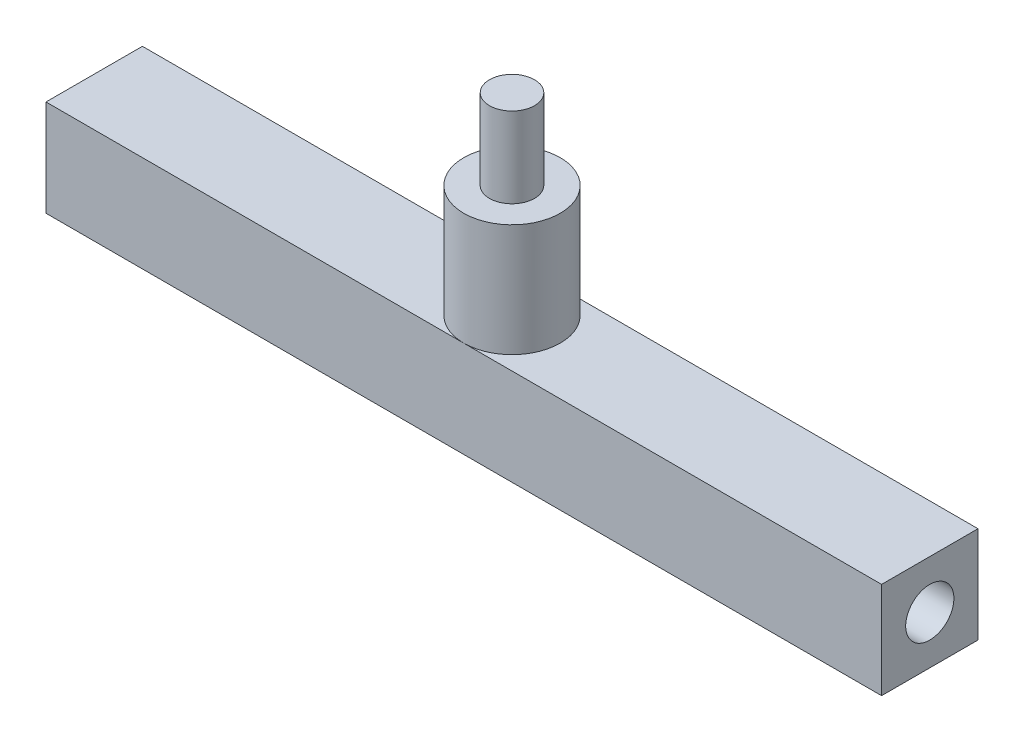
ISO-10303-21;
HEADER;
FILE_DESCRIPTION(('STEP AP214'),'2;1');
FILE_NAME('part.step','',(''),(''),'','','');
FILE_SCHEMA(('AUTOMOTIVE_DESIGN { 1 0 10303 214 1 1 1 1 }'));
ENDSEC;
DATA;
#1=APPLICATION_CONTEXT('core data for automotive mechanical design processes');
#2=APPLICATION_PROTOCOL_DEFINITION('international standard','automotive_design',2000,#1);
#3=PRODUCT_CONTEXT('',#1,'mechanical');
#4=PRODUCT('Part','Part','',(#3));
#5=PRODUCT_RELATED_PRODUCT_CATEGORY('part','',(#4));
#6=PRODUCT_DEFINITION_FORMATION('','',#4);
#7=PRODUCT_DEFINITION_CONTEXT('part definition',#1,'design');
#8=PRODUCT_DEFINITION('design','',#6,#7);
#9=PRODUCT_DEFINITION_SHAPE('','',#8);
#10=(LENGTH_UNIT() NAMED_UNIT(*) SI_UNIT(.MILLI.,.METRE.));
#11=(NAMED_UNIT(*) PLANE_ANGLE_UNIT() SI_UNIT($,.RADIAN.));
#12=(NAMED_UNIT(*) SI_UNIT($,.STERADIAN.) SOLID_ANGLE_UNIT());
#13=UNCERTAINTY_MEASURE_WITH_UNIT(LENGTH_MEASURE(1.E-05),#10,'distance_accuracy_value','');
#14=(GEOMETRIC_REPRESENTATION_CONTEXT(3) GLOBAL_UNCERTAINTY_ASSIGNED_CONTEXT((#13)) GLOBAL_UNIT_ASSIGNED_CONTEXT((#10,
#11,#12)) REPRESENTATION_CONTEXT('',''));
#15=CARTESIAN_POINT('',(0.,0.,0.));
#16=DIRECTION('',(0.,0.,1.));
#17=DIRECTION('',(1.,0.,0.));
#18=AXIS2_PLACEMENT_3D('',#15,#16,#17);
#19=CARTESIAN_POINT('',(0.,6.,0.));
#20=DIRECTION('',(0.,-1.,0.));
#21=DIRECTION('',(0.,0.,-1.));
#22=AXIS2_PLACEMENT_3D('',#19,#20,#21);
#23=PLANE('',#22);
#24=CARTESIAN_POINT('',(26.,6.,-3.));
#25=DIRECTION('',(0.,1.,0.));
#26=DIRECTION('',(0.,0.,1.));
#27=AXIS2_PLACEMENT_3D('',#24,#25,#26);
#28=CIRCLE('',#27,3.);
#29=CARTESIAN_POINT('',(26.,6.,0.));
#30=VERTEX_POINT('',#29);
#31=CARTESIAN_POINT('',(26.,6.,-6.));
#32=VERTEX_POINT('',#31);
#33=EDGE_CURVE('E43',#30,#32,#28,.T.);
#34=ORIENTED_EDGE('',*,*,#33,.F.);
#35=DIRECTION('',(1.,0.,0.));
#36=VECTOR('',#35,1.);
#37=CARTESIAN_POINT('',(0.,6.,0.));
#38=LINE('',#37,#36);
#39=CARTESIAN_POINT('',(52.,6.,0.));
#40=VERTEX_POINT('',#39);
#41=EDGE_CURVE('E134',#30,#40,#38,.T.);
#42=ORIENTED_EDGE('',*,*,#41,.T.);
#43=DIRECTION('',(0.,0.,-1.));
#44=VECTOR('',#43,1.);
#45=CARTESIAN_POINT('',(52.,6.,0.));
#46=LINE('',#45,#44);
#47=CARTESIAN_POINT('',(52.,6.,-6.));
#48=VERTEX_POINT('',#47);
#49=EDGE_CURVE('E136',#40,#48,#46,.T.);
#50=ORIENTED_EDGE('',*,*,#49,.T.);
#51=DIRECTION('',(-1.,0.,0.));
#52=VECTOR('',#51,1.);
#53=CARTESIAN_POINT('',(0.,6.,-6.));
#54=LINE('',#53,#52);
#55=EDGE_CURVE('E138',#48,#32,#54,.T.);
#56=ORIENTED_EDGE('',*,*,#55,.T.);
#57=EDGE_LOOP('',(#34,#42,#50,#56));
#58=FACE_BOUND('',#57,.T.);
#59=ADVANCED_FACE('F33',(#58),#23,.F.);
#60=CARTESIAN_POINT('',(0.,6.,0.));
#61=DIRECTION('',(1.,0.,0.));
#62=DIRECTION('',(0.,0.,-1.));
#63=AXIS2_PLACEMENT_3D('',#60,#61,#62);
#64=PLANE('',#63);
#65=CARTESIAN_POINT('',(0.,3.,-3.));
#66=DIRECTION('',(-1.,0.,0.));
#67=DIRECTION('',(0.,0.,1.));
#68=AXIS2_PLACEMENT_3D('',#65,#66,#67);
#69=CIRCLE('',#68,1.49999999999999);
#70=CARTESIAN_POINT('',(0.,3.,-1.50000000000001));
#71=VERTEX_POINT('',#70);
#72=EDGE_CURVE('E348',#71,#71,#69,.T.);
#73=ORIENTED_EDGE('',*,*,#72,.F.);
#74=EDGE_LOOP('',(#73));
#75=FACE_BOUND('',#74,.T.);
#76=DIRECTION('',(0.,0.,1.));
#77=VECTOR('',#76,1.);
#78=CARTESIAN_POINT('',(0.,0.,0.));
#79=LINE('',#78,#77);
#80=CARTESIAN_POINT('',(0.,0.,-6.));
#81=VERTEX_POINT('',#80);
#82=CARTESIAN_POINT('',(0.,0.,0.));
#83=VERTEX_POINT('',#82);
#84=EDGE_CURVE('E129',#81,#83,#79,.T.);
#85=ORIENTED_EDGE('',*,*,#84,.T.);
#86=DIRECTION('',(0.,-1.,0.));
#87=VECTOR('',#86,1.);
#88=CARTESIAN_POINT('',(0.,6.,0.));
#89=LINE('',#88,#87);
#90=CARTESIAN_POINT('',(0.,6.,0.));
#91=VERTEX_POINT('',#90);
#92=EDGE_CURVE('E37',#91,#83,#89,.T.);
#93=ORIENTED_EDGE('',*,*,#92,.F.);
#94=DIRECTION('',(0.,0.,1.));
#95=VECTOR('',#94,1.);
#96=CARTESIAN_POINT('',(0.,6.,0.));
#97=LINE('',#96,#95);
#98=CARTESIAN_POINT('',(0.,6.,-6.));
#99=VERTEX_POINT('',#98);
#100=EDGE_CURVE('E132',#99,#91,#97,.T.);
#101=ORIENTED_EDGE('',*,*,#100,.F.);
#102=DIRECTION('',(0.,-1.,0.));
#103=VECTOR('',#102,1.);
#104=CARTESIAN_POINT('',(0.,6.,-6.));
#105=LINE('',#104,#103);
#106=EDGE_CURVE('E141',#99,#81,#105,.T.);
#107=ORIENTED_EDGE('',*,*,#106,.T.);
#108=EDGE_LOOP('',(#85,#93,#101,#107));
#109=FACE_BOUND('',#108,.T.);
#110=ADVANCED_FACE('F35',(#75,#109),#64,.F.);
#111=CARTESIAN_POINT('',(0.,6.,0.));
#112=DIRECTION('',(0.,0.,-1.));
#113=DIRECTION('',(-1.,0.,0.));
#114=AXIS2_PLACEMENT_3D('',#111,#112,#113);
#115=PLANE('',#114);
#116=DIRECTION('',(1.,0.,0.));
#117=VECTOR('',#116,1.);
#118=CARTESIAN_POINT('',(0.,0.,0.));
#119=LINE('',#118,#117);
#120=CARTESIAN_POINT('',(52.,0.,0.));
#121=VERTEX_POINT('',#120);
#122=EDGE_CURVE('E144',#83,#121,#119,.T.);
#123=ORIENTED_EDGE('',*,*,#122,.T.);
#124=DIRECTION('',(0.,-1.,0.));
#125=VECTOR('',#124,1.);
#126=CARTESIAN_POINT('',(52.,6.,0.));
#127=LINE('',#126,#125);
#128=EDGE_CURVE('E151',#40,#121,#127,.T.);
#129=ORIENTED_EDGE('',*,*,#128,.F.);
#130=ORIENTED_EDGE('',*,*,#41,.F.);
#131=EDGE_CURVE('E82',#91,#30,#38,.T.);
#132=ORIENTED_EDGE('',*,*,#131,.F.);
#133=ORIENTED_EDGE('',*,*,#92,.T.);
#134=EDGE_LOOP('',(#123,#129,#130,#132,#133));
#135=FACE_BOUND('',#134,.T.);
#136=ADVANCED_FACE('F158',(#135),#115,.F.);
#137=CARTESIAN_POINT('',(52.,6.,0.));
#138=DIRECTION('',(-1.,0.,0.));
#139=DIRECTION('',(0.,0.,1.));
#140=AXIS2_PLACEMENT_3D('',#137,#138,#139);
#141=PLANE('',#140);
#142=CARTESIAN_POINT('',(52.,3.,-3.));
#143=DIRECTION('',(1.,0.,0.));
#144=DIRECTION('',(0.,0.,-1.));
#145=AXIS2_PLACEMENT_3D('',#142,#143,#144);
#146=CIRCLE('',#145,1.49999999999999);
#147=CARTESIAN_POINT('',(52.,3.,-4.49999999999999));
#148=VERTEX_POINT('',#147);
#149=EDGE_CURVE('E102',#148,#148,#146,.T.);
#150=ORIENTED_EDGE('',*,*,#149,.F.);
#151=EDGE_LOOP('',(#150));
#152=FACE_BOUND('',#151,.T.);
#153=DIRECTION('',(0.,0.,-1.));
#154=VECTOR('',#153,1.);
#155=CARTESIAN_POINT('',(52.,0.,0.));
#156=LINE('',#155,#154);
#157=CARTESIAN_POINT('',(52.,0.,-6.));
#158=VERTEX_POINT('',#157);
#159=EDGE_CURVE('E146',#121,#158,#156,.T.);
#160=ORIENTED_EDGE('',*,*,#159,.T.);
#161=DIRECTION('',(0.,-1.,0.));
#162=VECTOR('',#161,1.);
#163=CARTESIAN_POINT('',(52.,6.,-6.));
#164=LINE('',#163,#162);
#165=EDGE_CURVE('E150',#48,#158,#164,.T.);
#166=ORIENTED_EDGE('',*,*,#165,.F.);
#167=ORIENTED_EDGE('',*,*,#49,.F.);
#168=ORIENTED_EDGE('',*,*,#128,.T.);
#169=EDGE_LOOP('',(#160,#166,#167,#168));
#170=FACE_BOUND('',#169,.T.);
#171=ADVANCED_FACE('F165',(#152,#170),#141,.F.);
#172=CARTESIAN_POINT('',(0.,6.,-6.));
#173=DIRECTION('',(0.,0.,1.));
#174=DIRECTION('',(1.,0.,0.));
#175=AXIS2_PLACEMENT_3D('',#172,#173,#174);
#176=PLANE('',#175);
#177=DIRECTION('',(-1.,0.,0.));
#178=VECTOR('',#177,1.);
#179=CARTESIAN_POINT('',(0.,0.,-6.));
#180=LINE('',#179,#178);
#181=EDGE_CURVE('E75',#158,#81,#180,.T.);
#182=ORIENTED_EDGE('',*,*,#181,.T.);
#183=ORIENTED_EDGE('',*,*,#106,.F.);
#184=EDGE_CURVE('E53',#32,#99,#54,.T.);
#185=ORIENTED_EDGE('',*,*,#184,.F.);
#186=ORIENTED_EDGE('',*,*,#55,.F.);
#187=ORIENTED_EDGE('',*,*,#165,.T.);
#188=EDGE_LOOP('',(#182,#183,#185,#186,#187));
#189=FACE_BOUND('',#188,.T.);
#190=ADVANCED_FACE('F167',(#189),#176,.F.);
#191=EDGE_CURVE('E11',#32,#30,#28,.T.);
#192=ORIENTED_EDGE('',*,*,#191,.F.);
#193=ORIENTED_EDGE('',*,*,#184,.T.);
#194=ORIENTED_EDGE('',*,*,#100,.T.);
#195=ORIENTED_EDGE('',*,*,#131,.T.);
#196=EDGE_LOOP('',(#192,#193,#194,#195));
#197=FACE_BOUND('',#196,.T.);
#198=ADVANCED_FACE('F183',(#197),#23,.F.);
#199=CARTESIAN_POINT('',(0.,0.,0.));
#200=DIRECTION('',(0.,-1.,0.));
#201=DIRECTION('',(0.,0.,-1.));
#202=AXIS2_PLACEMENT_3D('',#199,#200,#201);
#203=PLANE('',#202);
#204=ORIENTED_EDGE('',*,*,#84,.F.);
#205=ORIENTED_EDGE('',*,*,#181,.F.);
#206=ORIENTED_EDGE('',*,*,#159,.F.);
#207=ORIENTED_EDGE('',*,*,#122,.F.);
#208=EDGE_LOOP('',(#204,#205,#206,#207));
#209=FACE_BOUND('',#208,.T.);
#210=ADVANCED_FACE('F163',(#209),#203,.T.);
#211=CARTESIAN_POINT('',(26.,13.,-3.));
#212=DIRECTION('',(0.,-1.,0.));
#213=DIRECTION('',(0.,0.,-1.));
#214=AXIS2_PLACEMENT_3D('',#211,#212,#213);
#215=CYLINDRICAL_SURFACE('',#214,3.);
#216=CARTESIAN_POINT('',(26.,13.,-3.));
#217=DIRECTION('',(0.,1.,0.));
#218=DIRECTION('',(0.,0.,1.));
#219=AXIS2_PLACEMENT_3D('',#216,#217,#218);
#220=CIRCLE('',#219,3.);
#221=CARTESIAN_POINT('',(26.,13.,0.));
#222=VERTEX_POINT('',#221);
#223=EDGE_CURVE('E127',#222,#222,#220,.T.);
#224=ORIENTED_EDGE('',*,*,#223,.F.);
#225=EDGE_LOOP('',(#224));
#226=FACE_BOUND('',#225,.T.);
#227=ORIENTED_EDGE('',*,*,#33,.T.);
#228=ORIENTED_EDGE('',*,*,#191,.T.);
#229=EDGE_LOOP('',(#227,#228));
#230=FACE_BOUND('',#229,.T.);
#231=ADVANCED_FACE('F171',(#226,#230),#215,.T.);
#232=CARTESIAN_POINT('',(26.,13.,-3.));
#233=DIRECTION('',(0.,1.,0.));
#234=DIRECTION('',(0.,0.,1.));
#235=AXIS2_PLACEMENT_3D('',#232,#233,#234);
#236=PLANE('',#235);
#237=CARTESIAN_POINT('',(26.,13.,-3.));
#238=DIRECTION('',(0.,1.,0.));
#239=DIRECTION('',(0.,0.,1.));
#240=AXIS2_PLACEMENT_3D('',#237,#238,#239);
#241=CIRCLE('',#240,1.4);
#242=CARTESIAN_POINT('',(26.,13.,-1.6));
#243=VERTEX_POINT('',#242);
#244=EDGE_CURVE('E121',#243,#243,#241,.T.);
#245=ORIENTED_EDGE('',*,*,#244,.F.);
#246=EDGE_LOOP('',(#245));
#247=FACE_BOUND('',#246,.T.);
#248=ORIENTED_EDGE('',*,*,#223,.T.);
#249=EDGE_LOOP('',(#248));
#250=FACE_BOUND('',#249,.T.);
#251=ADVANCED_FACE('F173',(#247,#250),#236,.T.);
#252=CARTESIAN_POINT('',(26.,18.,-3.));
#253=DIRECTION('',(0.,-1.,0.));
#254=DIRECTION('',(0.,0.,-1.));
#255=AXIS2_PLACEMENT_3D('',#252,#253,#254);
#256=CYLINDRICAL_SURFACE('',#255,1.4);
#257=CARTESIAN_POINT('',(26.,18.,-3.));
#258=DIRECTION('',(0.,1.,0.));
#259=DIRECTION('',(0.,0.,1.));
#260=AXIS2_PLACEMENT_3D('',#257,#258,#259);
#261=CIRCLE('',#260,1.4);
#262=CARTESIAN_POINT('',(26.,18.,-1.6));
#263=VERTEX_POINT('',#262);
#264=EDGE_CURVE('E122',#263,#263,#261,.T.);
#265=ORIENTED_EDGE('',*,*,#264,.F.);
#266=EDGE_LOOP('',(#265));
#267=FACE_BOUND('',#266,.T.);
#268=ORIENTED_EDGE('',*,*,#244,.T.);
#269=EDGE_LOOP('',(#268));
#270=FACE_BOUND('',#269,.T.);
#271=ADVANCED_FACE('F180',(#267,#270),#256,.T.);
#272=CARTESIAN_POINT('',(26.,18.,-3.));
#273=DIRECTION('',(0.,1.,0.));
#274=DIRECTION('',(0.,0.,1.));
#275=AXIS2_PLACEMENT_3D('',#272,#273,#274);
#276=PLANE('',#275);
#277=ORIENTED_EDGE('',*,*,#264,.T.);
#278=EDGE_LOOP('',(#277));
#279=FACE_BOUND('',#278,.T.);
#280=ADVANCED_FACE('F218',(#279),#276,.T.);
#281=CARTESIAN_POINT('',(44.5,3.,-3.));
#282=DIRECTION('',(1.,0.,0.));
#283=DIRECTION('',(0.,0.,-1.));
#284=AXIS2_PLACEMENT_3D('',#281,#282,#283);
#285=CONICAL_SURFACE('',#284,1.25,1.02974425867665);
#286=CARTESIAN_POINT('',(43.7489242262155,3.,-3.));
#287=VERTEX_POINT('',#286);
#288=VERTEX_LOOP('',#287);
#289=FACE_BOUND('',#288,.T.);
#290=CARTESIAN_POINT('',(44.5,3.,-3.));
#291=DIRECTION('',(1.,0.,0.));
#292=DIRECTION('',(0.,0.,-1.));
#293=AXIS2_PLACEMENT_3D('',#290,#291,#292);
#294=CIRCLE('',#293,1.25);
#295=CARTESIAN_POINT('',(44.5,3.,-4.25));
#296=VERTEX_POINT('',#295);
#297=EDGE_CURVE('E118',#296,#296,#294,.T.);
#298=ORIENTED_EDGE('',*,*,#297,.T.);
#299=EDGE_LOOP('',(#298));
#300=FACE_BOUND('',#299,.T.);
#301=ADVANCED_FACE('F223',(#289,#300),#285,.F.);
#302=CARTESIAN_POINT('',(52.,3.,-3.));
#303=DIRECTION('',(1.,0.,0.));
#304=DIRECTION('',(0.,0.,-1.));
#305=AXIS2_PLACEMENT_3D('',#302,#303,#304);
#306=CYLINDRICAL_SURFACE('',#305,1.25);
#307=ORIENTED_EDGE('',*,*,#297,.F.);
#308=EDGE_LOOP('',(#307));
#309=FACE_BOUND('',#308,.T.);
#310=CARTESIAN_POINT('',(46.,3.,-3.));
#311=DIRECTION('',(1.,0.,0.));
#312=DIRECTION('',(0.,0.,-1.));
#313=AXIS2_PLACEMENT_3D('',#310,#311,#312);
#314=CIRCLE('',#313,1.25);
#315=CARTESIAN_POINT('',(46.,3.,-4.25));
#316=VERTEX_POINT('',#315);
#317=EDGE_CURVE('E115',#316,#316,#314,.T.);
#318=ORIENTED_EDGE('',*,*,#317,.T.);
#319=EDGE_LOOP('',(#318));
#320=FACE_BOUND('',#319,.T.);
#321=ADVANCED_FACE('F228',(#309,#320),#306,.F.);
#322=CARTESIAN_POINT('',(46.,4.25,-3.));
#323=DIRECTION('',(-1.,0.,0.));
#324=DIRECTION('',(0.,0.,1.));
#325=AXIS2_PLACEMENT_3D('',#322,#323,#324);
#326=PLANE('',#325);
#327=ORIENTED_EDGE('',*,*,#317,.F.);
#328=EDGE_LOOP('',(#327));
#329=FACE_BOUND('',#328,.T.);
#330=CARTESIAN_POINT('',(46.,3.,-3.));
#331=DIRECTION('',(1.,0.,0.));
#332=DIRECTION('',(0.,0.,-1.));
#333=AXIS2_PLACEMENT_3D('',#330,#331,#332);
#334=CIRCLE('',#333,1.5);
#335=CARTESIAN_POINT('',(46.,3.,-4.5));
#336=VERTEX_POINT('',#335);
#337=EDGE_CURVE('E106',#336,#336,#334,.T.);
#338=ORIENTED_EDGE('',*,*,#337,.T.);
#339=EDGE_LOOP('',(#338));
#340=FACE_BOUND('',#339,.T.);
#341=ADVANCED_FACE('F238',(#329,#340),#326,.F.);
#342=CARTESIAN_POINT('',(52.,3.,-3.));
#343=DIRECTION('',(1.,0.,0.));
#344=DIRECTION('',(0.,0.,-1.));
#345=AXIS2_PLACEMENT_3D('',#342,#343,#344);
#346=CYLINDRICAL_SURFACE('',#345,1.49999999999999);
#347=ORIENTED_EDGE('',*,*,#337,.F.);
#348=EDGE_LOOP('',(#347));
#349=FACE_BOUND('',#348,.T.);
#350=ORIENTED_EDGE('',*,*,#149,.T.);
#351=EDGE_LOOP('',(#350));
#352=FACE_BOUND('',#351,.T.);
#353=ADVANCED_FACE('F96',(#349,#352),#346,.F.);
#354=CARTESIAN_POINT('',(7.5,3.,-3.));
#355=DIRECTION('',(-1.,0.,0.));
#356=DIRECTION('',(0.,0.,1.));
#357=AXIS2_PLACEMENT_3D('',#354,#355,#356);
#358=CONICAL_SURFACE('',#357,1.25,1.02974425867665);
#359=CARTESIAN_POINT('',(8.25107577378445,3.,-3.));
#360=VERTEX_POINT('',#359);
#361=VERTEX_LOOP('',#360);
#362=FACE_BOUND('',#361,.T.);
#363=CARTESIAN_POINT('',(7.5,3.,-3.));
#364=DIRECTION('',(-1.,0.,0.));
#365=DIRECTION('',(0.,0.,1.));
#366=AXIS2_PLACEMENT_3D('',#363,#364,#365);
#367=CIRCLE('',#366,1.25);
#368=CARTESIAN_POINT('',(7.5,3.,-1.75));
#369=VERTEX_POINT('',#368);
#370=EDGE_CURVE('E100',#369,#369,#367,.T.);
#371=ORIENTED_EDGE('',*,*,#370,.T.);
#372=EDGE_LOOP('',(#371));
#373=FACE_BOUND('',#372,.T.);
#374=ADVANCED_FACE('F92',(#362,#373),#358,.F.);
#375=CARTESIAN_POINT('',(0.,3.,-3.));
#376=DIRECTION('',(-1.,0.,0.));
#377=DIRECTION('',(0.,0.,1.));
#378=AXIS2_PLACEMENT_3D('',#375,#376,#377);
#379=CYLINDRICAL_SURFACE('',#378,1.25);
#380=ORIENTED_EDGE('',*,*,#370,.F.);
#381=EDGE_LOOP('',(#380));
#382=FACE_BOUND('',#381,.T.);
#383=CARTESIAN_POINT('',(6.,3.,-3.));
#384=DIRECTION('',(-1.,0.,0.));
#385=DIRECTION('',(0.,0.,1.));
#386=AXIS2_PLACEMENT_3D('',#383,#384,#385);
#387=CIRCLE('',#386,1.25);
#388=CARTESIAN_POINT('',(6.,3.,-1.75));
#389=VERTEX_POINT('',#388);
#390=EDGE_CURVE('E103',#389,#389,#387,.T.);
#391=ORIENTED_EDGE('',*,*,#390,.T.);
#392=EDGE_LOOP('',(#391));
#393=FACE_BOUND('',#392,.T.);
#394=ADVANCED_FACE('F95',(#382,#393),#379,.F.);
#395=CARTESIAN_POINT('',(6.,4.24999999999999,-3.));
#396=DIRECTION('',(1.,0.,0.));
#397=DIRECTION('',(0.,0.,-1.));
#398=AXIS2_PLACEMENT_3D('',#395,#396,#397);
#399=PLANE('',#398);
#400=ORIENTED_EDGE('',*,*,#390,.F.);
#401=EDGE_LOOP('',(#400));
#402=FACE_BOUND('',#401,.T.);
#403=CARTESIAN_POINT('',(6.,3.,-3.));
#404=DIRECTION('',(-1.,0.,0.));
#405=DIRECTION('',(0.,0.,1.));
#406=AXIS2_PLACEMENT_3D('',#403,#404,#405);
#407=CIRCLE('',#406,1.49999999999999);
#408=CARTESIAN_POINT('',(6.,3.,-1.50000000000001));
#409=VERTEX_POINT('',#408);
#410=EDGE_CURVE('E109',#409,#409,#407,.T.);
#411=ORIENTED_EDGE('',*,*,#410,.T.);
#412=EDGE_LOOP('',(#411));
#413=FACE_BOUND('',#412,.T.);
#414=ADVANCED_FACE('F276',(#402,#413),#399,.F.);
#415=CARTESIAN_POINT('',(0.,3.,-3.));
#416=DIRECTION('',(-1.,0.,0.));
#417=DIRECTION('',(0.,0.,1.));
#418=AXIS2_PLACEMENT_3D('',#415,#416,#417);
#419=CYLINDRICAL_SURFACE('',#418,1.49999999999999);
#420=ORIENTED_EDGE('',*,*,#410,.F.);
#421=EDGE_LOOP('',(#420));
#422=FACE_BOUND('',#421,.T.);
#423=ORIENTED_EDGE('',*,*,#72,.T.);
#424=EDGE_LOOP('',(#423));
#425=FACE_BOUND('',#424,.T.);
#426=ADVANCED_FACE('F285',(#422,#425),#419,.F.);
#427=CLOSED_SHELL('',(#59,#110,#136,#171,#190,#198,#210,#231,#251,#271,#280,#301,#321,#341,#353,
#374,#394,#414,#426));
#428=MANIFOLD_SOLID_BREP('B2',#427);
#429=ADVANCED_BREP_SHAPE_REPRESENTATION('',(#18,#428),#14);
#430=SHAPE_DEFINITION_REPRESENTATION(#9,#429);
ENDSEC;
END-ISO-10303-21;
